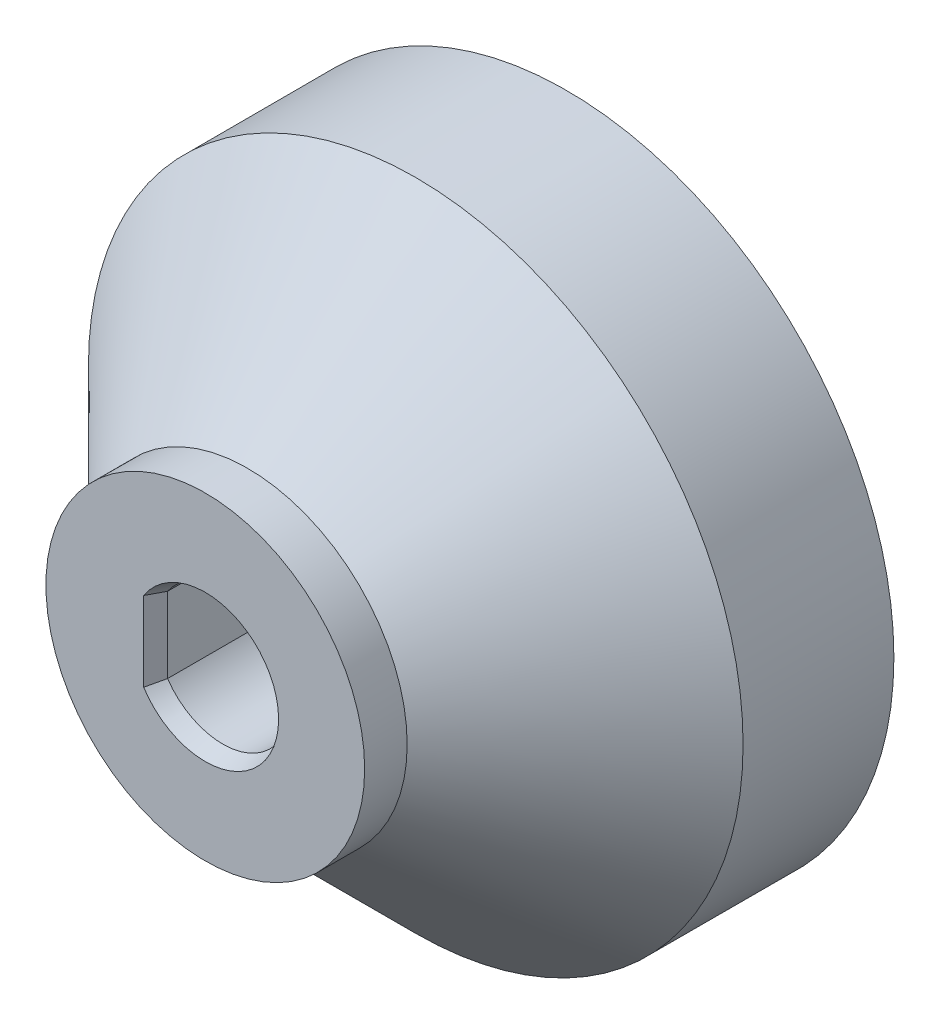
ISO-10303-21;
HEADER;
FILE_DESCRIPTION(('STEP AP214'),'2;1');
FILE_NAME('part.step','',(''),(''),'','','');
FILE_SCHEMA(('AUTOMOTIVE_DESIGN { 1 0 10303 214 1 1 1 1 }'));
ENDSEC;
DATA;
#1=APPLICATION_CONTEXT('core data for automotive mechanical design processes');
#2=APPLICATION_PROTOCOL_DEFINITION('international standard','automotive_design',2000,#1);
#3=PRODUCT_CONTEXT('',#1,'mechanical');
#4=PRODUCT('Part','Part','',(#3));
#5=PRODUCT_RELATED_PRODUCT_CATEGORY('part','',(#4));
#6=PRODUCT_DEFINITION_FORMATION('','',#4);
#7=PRODUCT_DEFINITION_CONTEXT('part definition',#1,'design');
#8=PRODUCT_DEFINITION('design','',#6,#7);
#9=PRODUCT_DEFINITION_SHAPE('','',#8);
#10=(LENGTH_UNIT() NAMED_UNIT(*) SI_UNIT(.MILLI.,.METRE.));
#11=(NAMED_UNIT(*) PLANE_ANGLE_UNIT() SI_UNIT($,.RADIAN.));
#12=(NAMED_UNIT(*) SI_UNIT($,.STERADIAN.) SOLID_ANGLE_UNIT());
#13=UNCERTAINTY_MEASURE_WITH_UNIT(LENGTH_MEASURE(1.E-05),#10,'distance_accuracy_value','');
#14=(GEOMETRIC_REPRESENTATION_CONTEXT(3) GLOBAL_UNCERTAINTY_ASSIGNED_CONTEXT((#13)) GLOBAL_UNIT_ASSIGNED_CONTEXT((#10,
#11,#12)) REPRESENTATION_CONTEXT('',''));
#15=CARTESIAN_POINT('',(0.,0.,0.));
#16=DIRECTION('',(0.,0.,1.));
#17=DIRECTION('',(1.,0.,0.));
#18=AXIS2_PLACEMENT_3D('',#15,#16,#17);
#19=CARTESIAN_POINT('',(0.,0.,10.));
#20=DIRECTION('',(0.,0.,-1.));
#21=DIRECTION('',(-1.,0.,0.));
#22=AXIS2_PLACEMENT_3D('',#19,#20,#21);
#23=CYLINDRICAL_SURFACE('',#22,3.15);
#24=DIRECTION('',(0.,0.,-1.));
#25=VECTOR('',#24,1.);
#26=CARTESIAN_POINT('',(-2.6,-1.77834192437787,10.));
#27=LINE('',#26,#25);
#28=CARTESIAN_POINT('',(-2.6,-1.77834192437787,9.17575677416363));
#29=VERTEX_POINT('',#28);
#30=CARTESIAN_POINT('',(-2.6,-1.77834192437787,0.));
#31=VERTEX_POINT('',#30);
#32=EDGE_CURVE('E77',#29,#31,#27,.T.);
#33=ORIENTED_EDGE('',*,*,#32,.F.);
#34=CARTESIAN_POINT('',(0.,0.,9.17575677416363));
#35=DIRECTION('',(0.,0.,1.));
#36=DIRECTION('',(1.,0.,0.));
#37=AXIS2_PLACEMENT_3D('',#34,#35,#36);
#38=CIRCLE('',#37,3.15);
#39=CARTESIAN_POINT('',(-2.6,1.77834192437787,9.17575677416363));
#40=VERTEX_POINT('',#39);
#41=EDGE_CURVE('E109',#29,#40,#38,.T.);
#42=ORIENTED_EDGE('',*,*,#41,.T.);
#43=DIRECTION('',(0.,0.,-1.));
#44=VECTOR('',#43,1.);
#45=CARTESIAN_POINT('',(-2.6,1.77834192437787,10.));
#46=LINE('',#45,#44);
#47=CARTESIAN_POINT('',(-2.6,1.77834192437787,0.));
#48=VERTEX_POINT('',#47);
#49=EDGE_CURVE('E87',#40,#48,#46,.T.);
#50=ORIENTED_EDGE('',*,*,#49,.T.);
#51=CARTESIAN_POINT('',(0.,0.,0.));
#52=DIRECTION('',(0.,0.,1.));
#53=DIRECTION('',(1.,0.,0.));
#54=AXIS2_PLACEMENT_3D('',#51,#52,#53);
#55=CIRCLE('',#54,3.15);
#56=EDGE_CURVE('E89',#31,#48,#55,.T.);
#57=ORIENTED_EDGE('',*,*,#56,.F.);
#58=EDGE_LOOP('',(#33,#42,#50,#57));
#59=FACE_BOUND('',#58,.T.);
#60=ADVANCED_FACE('F35',(#59),#23,.F.);
#61=CARTESIAN_POINT('',(-2.6,0.,10.));
#62=DIRECTION('',(1.,0.,0.));
#63=DIRECTION('',(0.,0.,-1.));
#64=AXIS2_PLACEMENT_3D('',#61,#62,#63);
#65=PLANE('',#64);
#66=ORIENTED_EDGE('',*,*,#49,.F.);
#67=DIRECTION('',(0.,-1.,0.));
#68=VECTOR('',#67,1.);
#69=CARTESIAN_POINT('',(-2.6,0.,9.17575677416363));
#70=LINE('',#69,#68);
#71=EDGE_CURVE('E84',#40,#29,#70,.T.);
#72=ORIENTED_EDGE('',*,*,#71,.T.);
#73=ORIENTED_EDGE('',*,*,#32,.T.);
#74=DIRECTION('',(0.,-1.,0.));
#75=VECTOR('',#74,1.);
#76=CARTESIAN_POINT('',(-2.6,0.,0.));
#77=LINE('',#76,#75);
#78=EDGE_CURVE('E82',#48,#31,#77,.T.);
#79=ORIENTED_EDGE('',*,*,#78,.F.);
#80=EDGE_LOOP('',(#66,#72,#73,#79));
#81=FACE_BOUND('',#80,.T.);
#82=ADVANCED_FACE('F80',(#81),#65,.T.);
#83=CARTESIAN_POINT('',(0.,0.,10.));
#84=DIRECTION('',(0.,0.,-1.));
#85=DIRECTION('',(-1.,0.,0.));
#86=AXIS2_PLACEMENT_3D('',#83,#84,#85);
#87=CYLINDRICAL_SURFACE('',#86,7.5);
#88=CARTESIAN_POINT('',(0.,0.,8.00000000000014));
#89=DIRECTION('',(0.,0.,1.));
#90=DIRECTION('',(1.,0.,0.));
#91=AXIS2_PLACEMENT_3D('',#88,#89,#90);
#92=CIRCLE('',#91,7.5);
#93=CARTESIAN_POINT('',(7.5,0.,8.00000000000014));
#94=VERTEX_POINT('',#93);
#95=EDGE_CURVE('E86',#94,#94,#92,.T.);
#96=ORIENTED_EDGE('',*,*,#95,.T.);
#97=EDGE_LOOP('',(#96));
#98=FACE_BOUND('',#97,.T.);
#99=CARTESIAN_POINT('',(0.,0.,10.));
#100=DIRECTION('',(0.,0.,1.));
#101=DIRECTION('',(1.,0.,0.));
#102=AXIS2_PLACEMENT_3D('',#99,#100,#101);
#103=CIRCLE('',#102,7.5);
#104=CARTESIAN_POINT('',(7.5,0.,10.));
#105=VERTEX_POINT('',#104);
#106=EDGE_CURVE('E94',#105,#105,#103,.T.);
#107=ORIENTED_EDGE('',*,*,#106,.F.);
#108=EDGE_LOOP('',(#107));
#109=FACE_BOUND('',#108,.T.);
#110=ADVANCED_FACE('F137',(#98,#109),#87,.T.);
#111=CARTESIAN_POINT('',(0.,0.,10.));
#112=DIRECTION('',(0.,0.,1.));
#113=DIRECTION('',(1.,0.,0.));
#114=AXIS2_PLACEMENT_3D('',#111,#112,#113);
#115=PLANE('',#114);
#116=CARTESIAN_POINT('',(0.,0.,10.));
#117=DIRECTION('',(0.,0.,1.));
#118=DIRECTION('',(1.,0.,0.));
#119=AXIS2_PLACEMENT_3D('',#116,#117,#118);
#120=CIRCLE('',#119,3.45);
#121=CARTESIAN_POINT('',(-2.89999999999991,1.86882315910321,10.));
#122=VERTEX_POINT('',#121);
#123=CARTESIAN_POINT('',(-2.89999999999991,-1.86882315910321,10.));
#124=VERTEX_POINT('',#123);
#125=EDGE_CURVE('E55',#122,#124,#120,.F.);
#126=ORIENTED_EDGE('',*,*,#125,.T.);
#127=DIRECTION('',(0.,1.,0.));
#128=VECTOR('',#127,1.);
#129=CARTESIAN_POINT('',(-2.9,0.,10.));
#130=LINE('',#129,#128);
#131=EDGE_CURVE('E107',#124,#122,#130,.T.);
#132=ORIENTED_EDGE('',*,*,#131,.T.);
#133=EDGE_LOOP('',(#126,#132));
#134=FACE_BOUND('',#133,.T.);
#135=ORIENTED_EDGE('',*,*,#106,.T.);
#136=EDGE_LOOP('',(#135));
#137=FACE_BOUND('',#136,.T.);
#138=ADVANCED_FACE('F142',(#134,#137),#115,.T.);
#139=CARTESIAN_POINT('',(0.,0.,-7.));
#140=DIRECTION('',(0.,0.,1.));
#141=DIRECTION('',(1.,0.,0.));
#142=AXIS2_PLACEMENT_3D('',#139,#140,#141);
#143=PLANE('',#142);
#144=CARTESIAN_POINT('',(0.,5.,-7.));
#145=DIRECTION('',(0.,0.,1.));
#146=DIRECTION('',(1.,0.,0.));
#147=AXIS2_PLACEMENT_3D('',#144,#145,#146);
#148=CIRCLE('',#147,6.86);
#149=CARTESIAN_POINT('',(6.86,5.,-7.));
#150=VERTEX_POINT('',#149);
#151=EDGE_CURVE('E11',#150,#150,#148,.T.);
#152=ORIENTED_EDGE('',*,*,#151,.T.);
#153=EDGE_LOOP('',(#152));
#154=FACE_BOUND('',#153,.T.);
#155=CARTESIAN_POINT('',(0.,0.,-7.));
#156=DIRECTION('',(0.,0.,1.));
#157=DIRECTION('',(1.,0.,0.));
#158=AXIS2_PLACEMENT_3D('',#155,#156,#157);
#159=CIRCLE('',#158,15.403290795);
#160=CARTESIAN_POINT('',(15.403290795,0.,-7.));
#161=VERTEX_POINT('',#160);
#162=EDGE_CURVE('E91',#161,#161,#159,.T.);
#163=ORIENTED_EDGE('',*,*,#162,.F.);
#164=EDGE_LOOP('',(#163));
#165=FACE_BOUND('',#164,.T.);
#166=ADVANCED_FACE('F146',(#154,#165),#143,.F.);
#167=CARTESIAN_POINT('',(0.,0.,-7.));
#168=DIRECTION('',(0.,0.,1.));
#169=DIRECTION('',(1.,0.,0.));
#170=AXIS2_PLACEMENT_3D('',#167,#168,#169);
#171=CYLINDRICAL_SURFACE('',#170,15.403290795);
#172=CARTESIAN_POINT('',(0.,0.,0.0967092050000572));
#173=DIRECTION('',(0.,0.,-1.));
#174=DIRECTION('',(-1.,0.,0.));
#175=AXIS2_PLACEMENT_3D('',#172,#173,#174);
#176=CIRCLE('',#175,15.403290795);
#177=CARTESIAN_POINT('',(-15.403290795,0.,0.0967092050000572));
#178=VERTEX_POINT('',#177);
#179=EDGE_CURVE('E102',#178,#178,#176,.T.);
#180=ORIENTED_EDGE('',*,*,#179,.T.);
#181=EDGE_LOOP('',(#180));
#182=FACE_BOUND('',#181,.T.);
#183=ORIENTED_EDGE('',*,*,#162,.T.);
#184=EDGE_LOOP('',(#183));
#185=FACE_BOUND('',#184,.T.);
#186=ADVANCED_FACE('F147',(#182,#185),#171,.T.);
#187=CARTESIAN_POINT('',(0.,0.,0.));
#188=DIRECTION('',(0.,0.,1.));
#189=DIRECTION('',(1.,0.,0.));
#190=AXIS2_PLACEMENT_3D('',#187,#188,#189);
#191=PLANE('',#190);
#192=ORIENTED_EDGE('',*,*,#78,.T.);
#193=ORIENTED_EDGE('',*,*,#56,.T.);
#194=EDGE_LOOP('',(#192,#193));
#195=FACE_BOUND('',#194,.T.);
#196=ADVANCED_FACE('F93',(#195),#191,.T.);
#197=CARTESIAN_POINT('',(0.,5.,-2.));
#198=DIRECTION('',(0.,0.,-1.));
#199=DIRECTION('',(-1.,0.,0.));
#200=AXIS2_PLACEMENT_3D('',#197,#198,#199);
#201=CYLINDRICAL_SURFACE('',#200,6.56);
#202=CARTESIAN_POINT('',(0.,5.,-6.17575677416361));
#203=DIRECTION('',(0.,0.,1.));
#204=DIRECTION('',(1.,0.,0.));
#205=AXIS2_PLACEMENT_3D('',#202,#203,#204);
#206=CIRCLE('',#205,6.56);
#207=CARTESIAN_POINT('',(6.56,5.,-6.17575677416361));
#208=VERTEX_POINT('',#207);
#209=EDGE_CURVE('E48',#208,#208,#206,.F.);
#210=ORIENTED_EDGE('',*,*,#209,.T.);
#211=EDGE_LOOP('',(#210));
#212=FACE_BOUND('',#211,.T.);
#213=CARTESIAN_POINT('',(0.,5.,-2.));
#214=DIRECTION('',(0.,0.,-1.));
#215=DIRECTION('',(-1.,0.,0.));
#216=AXIS2_PLACEMENT_3D('',#213,#214,#215);
#217=CIRCLE('',#216,6.56);
#218=CARTESIAN_POINT('',(-6.56,5.,-2.));
#219=VERTEX_POINT('',#218);
#220=EDGE_CURVE('E166',#219,#219,#217,.T.);
#221=ORIENTED_EDGE('',*,*,#220,.F.);
#222=EDGE_LOOP('',(#221));
#223=FACE_BOUND('',#222,.T.);
#224=ADVANCED_FACE('F153',(#212,#223),#201,.F.);
#225=CARTESIAN_POINT('',(0.,5.,-2.));
#226=DIRECTION('',(0.,0.,-1.));
#227=DIRECTION('',(-1.,0.,0.));
#228=AXIS2_PLACEMENT_3D('',#225,#226,#227);
#229=PLANE('',#228);
#230=ORIENTED_EDGE('',*,*,#220,.T.);
#231=EDGE_LOOP('',(#230));
#232=FACE_BOUND('',#231,.T.);
#233=ADVANCED_FACE('F129',(#232),#229,.T.);
#234=CARTESIAN_POINT('',(0.,0.,8.00000000000014));
#235=DIRECTION('',(0.,0.,-1.));
#236=DIRECTION('',(-1.,0.,0.));
#237=AXIS2_PLACEMENT_3D('',#234,#235,#236);
#238=CONICAL_SURFACE('',#237,7.5,0.785398163397443);
#239=ORIENTED_EDGE('',*,*,#179,.F.);
#240=EDGE_LOOP('',(#239));
#241=FACE_BOUND('',#240,.T.);
#242=ORIENTED_EDGE('',*,*,#95,.F.);
#243=EDGE_LOOP('',(#242));
#244=FACE_BOUND('',#243,.T.);
#245=ADVANCED_FACE('F122',(#241,#244),#238,.T.);
#246=CARTESIAN_POINT('',(0.,0.,9.17575677416363));
#247=DIRECTION('',(0.,0.,1.));
#248=DIRECTION('',(1.,0.,0.));
#249=AXIS2_PLACEMENT_3D('',#246,#247,#248);
#250=CONICAL_SURFACE('',#249,3.15,0.349065850398869);
#251=CARTESIAN_POINT('',(-2.6,-1.77834192437787,9.17575677416363));
#252=CARTESIAN_POINT('',(-2.64998694527946,-1.79379225600958,9.31309477758646));
#253=CARTESIAN_POINT('',(-2.69998041974115,-1.8090575252551,9.45045071979004));
#254=CARTESIAN_POINT('',(-2.79998041974306,-1.8392179367763,9.72519846174073));
#255=CARTESIAN_POINT('',(-2.84998694528136,-1.85411307910591,9.8625902614826));
#256=CARTESIAN_POINT('',(-2.9,-1.86882315910328,10.));
#257=B_SPLINE_CURVE_WITH_KNOTS('',3,(#251,#252,#253,#254,#255,#256),.UNSPECIFIED.,.F.,.F.,(4,2,
4),(0.,0.440898261657634,0.881796459067977),.UNSPECIFIED.);
#258=EDGE_CURVE('E112',#124,#29,#257,.F.);
#259=ORIENTED_EDGE('',*,*,#258,.F.);
#260=ORIENTED_EDGE('',*,*,#125,.F.);
#261=CARTESIAN_POINT('',(-2.9,1.86882315910327,10.));
#262=CARTESIAN_POINT('',(-2.84998694528136,1.85411307910588,9.8625902614826));
#263=CARTESIAN_POINT('',(-2.79998041974306,1.83921793677627,9.72519846174073));
#264=CARTESIAN_POINT('',(-2.69998041974115,1.80905752525513,9.45045071979004));
#265=CARTESIAN_POINT('',(-2.64998694527946,1.79379225600967,9.31309477758645));
#266=CARTESIAN_POINT('',(-2.59999999999999,1.77834192437805,9.17575677416361));
#267=B_SPLINE_CURVE_WITH_KNOTS('',3,(#261,#262,#263,#264,#265,#266),.UNSPECIFIED.,.F.,.F.,(4,2,
4),(0.,0.440898197410344,0.881796459067976),.UNSPECIFIED.);
#268=EDGE_CURVE('E39',#40,#122,#267,.F.);
#269=ORIENTED_EDGE('',*,*,#268,.F.);
#270=ORIENTED_EDGE('',*,*,#41,.F.);
#271=EDGE_LOOP('',(#259,#260,#269,#270));
#272=FACE_BOUND('',#271,.T.);
#273=ADVANCED_FACE('F119',(#272),#250,.F.);
#274=CARTESIAN_POINT('',(-2.6,0.,9.17575677416363));
#275=DIRECTION('',(-0.939692620785907,0.,-0.342020143325672));
#276=DIRECTION('',(0.,-1.,0.));
#277=AXIS2_PLACEMENT_3D('',#274,#275,#276);
#278=PLANE('',#277);
#279=ORIENTED_EDGE('',*,*,#268,.T.);
#280=ORIENTED_EDGE('',*,*,#131,.F.);
#281=ORIENTED_EDGE('',*,*,#258,.T.);
#282=ORIENTED_EDGE('',*,*,#71,.F.);
#283=EDGE_LOOP('',(#279,#280,#281,#282));
#284=FACE_BOUND('',#283,.T.);
#285=ADVANCED_FACE('F116',(#284),#278,.F.);
#286=CARTESIAN_POINT('',(0.,5.,-6.17575677416361));
#287=DIRECTION('',(0.,0.,-1.));
#288=DIRECTION('',(-1.,0.,0.));
#289=AXIS2_PLACEMENT_3D('',#286,#287,#288);
#290=CONICAL_SURFACE('',#289,6.56,0.349065850398863);
#291=ORIENTED_EDGE('',*,*,#151,.F.);
#292=EDGE_LOOP('',(#291));
#293=FACE_BOUND('',#292,.T.);
#294=ORIENTED_EDGE('',*,*,#209,.F.);
#295=EDGE_LOOP('',(#294));
#296=FACE_BOUND('',#295,.T.);
#297=ADVANCED_FACE('F37',(#293,#296),#290,.F.);
#298=CLOSED_SHELL('',(#60,#82,#110,#138,#166,#186,#196,#224,#233,#245,#273,#285,#297));
#299=MANIFOLD_SOLID_BREP('B2',#298);
#300=ADVANCED_BREP_SHAPE_REPRESENTATION('',(#18,#299),#14);
#301=SHAPE_DEFINITION_REPRESENTATION(#9,#300);
ENDSEC;
END-ISO-10303-21;
